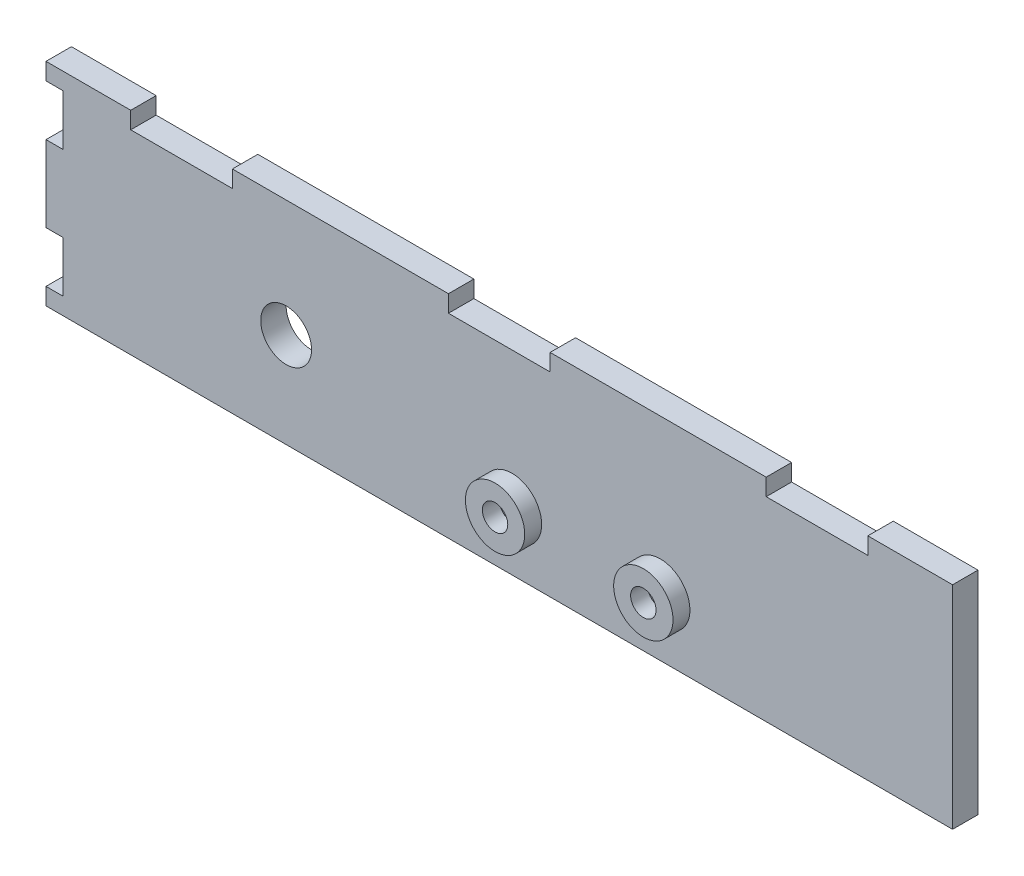
ISO-10303-21;
HEADER;
FILE_DESCRIPTION(('STEP AP214'),'2;1');
FILE_NAME('part.step','',(''),(''),'','','');
FILE_SCHEMA(('AUTOMOTIVE_DESIGN { 1 0 10303 214 1 1 1 1 }'));
ENDSEC;
DATA;
#1=APPLICATION_CONTEXT('core data for automotive mechanical design processes');
#2=APPLICATION_PROTOCOL_DEFINITION('international standard','automotive_design',2000,#1);
#3=PRODUCT_CONTEXT('',#1,'mechanical');
#4=PRODUCT('Part','Part','',(#3));
#5=PRODUCT_RELATED_PRODUCT_CATEGORY('part','',(#4));
#6=PRODUCT_DEFINITION_FORMATION('','',#4);
#7=PRODUCT_DEFINITION_CONTEXT('part definition',#1,'design');
#8=PRODUCT_DEFINITION('design','',#6,#7);
#9=PRODUCT_DEFINITION_SHAPE('','',#8);
#10=(LENGTH_UNIT() NAMED_UNIT(*) SI_UNIT(.MILLI.,.METRE.));
#11=(NAMED_UNIT(*) PLANE_ANGLE_UNIT() SI_UNIT($,.RADIAN.));
#12=(NAMED_UNIT(*) SI_UNIT($,.STERADIAN.) SOLID_ANGLE_UNIT());
#13=UNCERTAINTY_MEASURE_WITH_UNIT(LENGTH_MEASURE(1.E-05),#10,'distance_accuracy_value','');
#14=(GEOMETRIC_REPRESENTATION_CONTEXT(3) GLOBAL_UNCERTAINTY_ASSIGNED_CONTEXT((#13)) GLOBAL_UNIT_ASSIGNED_CONTEXT((#10,
#11,#12)) REPRESENTATION_CONTEXT('',''));
#15=CARTESIAN_POINT('',(0.,0.,0.));
#16=DIRECTION('',(0.,0.,1.));
#17=DIRECTION('',(1.,0.,0.));
#18=AXIS2_PLACEMENT_3D('',#15,#16,#17);
#19=CARTESIAN_POINT('',(0.,0.,3.));
#20=DIRECTION('',(0.,0.,1.));
#21=DIRECTION('',(1.,0.,0.));
#22=AXIS2_PLACEMENT_3D('',#19,#20,#21);
#23=PLANE('',#22);
#24=CARTESIAN_POINT('',(14.3223140495868,15.171694214876,3.));
#25=DIRECTION('',(0.,0.,1.));
#26=DIRECTION('',(1.,0.,0.));
#27=AXIS2_PLACEMENT_3D('',#24,#25,#26);
#28=CIRCLE('',#27,3.5);
#29=CARTESIAN_POINT('',(17.8223140495868,15.171694214876,3.));
#30=VERTEX_POINT('',#29);
#31=EDGE_CURVE('E242',#30,#30,#28,.F.);
#32=ORIENTED_EDGE('',*,*,#31,.T.);
#33=EDGE_LOOP('',(#32));
#34=FACE_BOUND('',#33,.T.);
#35=CARTESIAN_POINT('',(-12.336122998152,19.4527845166274,3.));
#36=DIRECTION('',(0.,0.,1.));
#37=DIRECTION('',(1.,0.,0.));
#38=AXIS2_PLACEMENT_3D('',#35,#36,#37);
#39=CIRCLE('',#38,3.);
#40=CARTESIAN_POINT('',(-9.33612299815198,19.4527845166274,3.));
#41=VERTEX_POINT('',#40);
#42=EDGE_CURVE('E297',#41,#41,#39,.T.);
#43=ORIENTED_EDGE('',*,*,#42,.F.);
#44=EDGE_LOOP('',(#43));
#45=FACE_BOUND('',#44,.T.);
#46=DIRECTION('',(-1.,0.,0.));
#47=VECTOR('',#46,1.);
#48=CARTESIAN_POINT('',(0.,31.271694214876,3.));
#49=LINE('',#48,#47);
#50=CARTESIAN_POINT('',(56.3223140495868,31.271694214876,3.));
#51=VERTEX_POINT('',#50);
#52=CARTESIAN_POINT('',(44.3223140495868,31.271694214876,3.));
#53=VERTEX_POINT('',#52);
#54=EDGE_CURVE('E149',#51,#53,#49,.T.);
#55=ORIENTED_EDGE('',*,*,#54,.T.);
#56=DIRECTION('',(0.,-1.,0.));
#57=VECTOR('',#56,1.);
#58=CARTESIAN_POINT('',(44.3223140495868,0.,3.));
#59=LINE('',#58,#57);
#60=CARTESIAN_POINT('',(44.3223140495868,33.271694214876,3.));
#61=VERTEX_POINT('',#60);
#62=EDGE_CURVE('E380',#61,#53,#59,.T.);
#63=ORIENTED_EDGE('',*,*,#62,.F.);
#64=DIRECTION('',(1.,0.,0.));
#65=VECTOR('',#64,1.);
#66=CARTESIAN_POINT('',(0.,33.271694214876,3.));
#67=LINE('',#66,#65);
#68=CARTESIAN_POINT('',(18.8223140495868,33.271694214876,3.));
#69=VERTEX_POINT('',#68);
#70=EDGE_CURVE('E385',#69,#61,#67,.T.);
#71=ORIENTED_EDGE('',*,*,#70,.F.);
#72=DIRECTION('',(0.,-1.,0.));
#73=VECTOR('',#72,1.);
#74=CARTESIAN_POINT('',(18.8223140495868,0.,3.));
#75=LINE('',#74,#73);
#76=CARTESIAN_POINT('',(18.8223140495868,31.271694214876,3.));
#77=VERTEX_POINT('',#76);
#78=EDGE_CURVE('E388',#69,#77,#75,.T.);
#79=ORIENTED_EDGE('',*,*,#78,.T.);
#80=CARTESIAN_POINT('',(6.82231404958676,31.271694214876,3.));
#81=VERTEX_POINT('',#80);
#82=EDGE_CURVE('E382',#77,#81,#49,.T.);
#83=ORIENTED_EDGE('',*,*,#82,.T.);
#84=DIRECTION('',(0.,-1.,0.));
#85=VECTOR('',#84,1.);
#86=CARTESIAN_POINT('',(6.82231404958676,0.,3.));
#87=LINE('',#86,#85);
#88=CARTESIAN_POINT('',(6.82231404958676,33.271694214876,3.));
#89=VERTEX_POINT('',#88);
#90=EDGE_CURVE('E390',#89,#81,#87,.T.);
#91=ORIENTED_EDGE('',*,*,#90,.F.);
#92=DIRECTION('',(1.,0.,0.));
#93=VECTOR('',#92,1.);
#94=CARTESIAN_POINT('',(0.,33.271694214876,3.));
#95=LINE('',#94,#93);
#96=CARTESIAN_POINT('',(-18.6776859504132,33.271694214876,3.));
#97=VERTEX_POINT('',#96);
#98=EDGE_CURVE('E393',#97,#89,#95,.T.);
#99=ORIENTED_EDGE('',*,*,#98,.F.);
#100=DIRECTION('',(0.,-1.,0.));
#101=VECTOR('',#100,1.);
#102=CARTESIAN_POINT('',(-18.6776859504132,0.,3.));
#103=LINE('',#102,#101);
#104=CARTESIAN_POINT('',(-18.6776859504132,31.271694214876,3.));
#105=VERTEX_POINT('',#104);
#106=EDGE_CURVE('E396',#97,#105,#103,.T.);
#107=ORIENTED_EDGE('',*,*,#106,.T.);
#108=CARTESIAN_POINT('',(-30.6776859504132,31.271694214876,3.));
#109=VERTEX_POINT('',#108);
#110=EDGE_CURVE('E381',#105,#109,#49,.T.);
#111=ORIENTED_EDGE('',*,*,#110,.T.);
#112=DIRECTION('',(0.,-1.,0.));
#113=VECTOR('',#112,1.);
#114=CARTESIAN_POINT('',(-30.6776859504133,1.06434604013651E-13,3.));
#115=LINE('',#114,#113);
#116=CARTESIAN_POINT('',(-30.6776859504132,33.271694214876,3.));
#117=VERTEX_POINT('',#116);
#118=EDGE_CURVE('E398',#117,#109,#115,.T.);
#119=ORIENTED_EDGE('',*,*,#118,.F.);
#120=DIRECTION('',(1.,0.,0.));
#121=VECTOR('',#120,1.);
#122=CARTESIAN_POINT('',(0.,33.271694214876,3.));
#123=LINE('',#122,#121);
#124=CARTESIAN_POINT('',(-40.6776859504132,33.271694214876,3.));
#125=VERTEX_POINT('',#124);
#126=EDGE_CURVE('E401',#125,#117,#123,.T.);
#127=ORIENTED_EDGE('',*,*,#126,.F.);
#128=DIRECTION('',(0.,-1.,0.));
#129=VECTOR('',#128,1.);
#130=CARTESIAN_POINT('',(-40.6776859504132,0.,3.));
#131=LINE('',#130,#129);
#132=CARTESIAN_POINT('',(-40.6776859504132,31.271694214876,3.));
#133=VERTEX_POINT('',#132);
#134=EDGE_CURVE('E404',#125,#133,#131,.T.);
#135=ORIENTED_EDGE('',*,*,#134,.T.);
#136=DIRECTION('',(-1.,0.,0.));
#137=VECTOR('',#136,1.);
#138=CARTESIAN_POINT('',(0.,31.271694214876,3.));
#139=LINE('',#138,#137);
#140=CARTESIAN_POINT('',(-38.6776859504132,31.271694214876,3.));
#141=VERTEX_POINT('',#140);
#142=EDGE_CURVE('E406',#141,#133,#139,.T.);
#143=ORIENTED_EDGE('',*,*,#142,.F.);
#144=DIRECTION('',(0.,-1.,0.));
#145=VECTOR('',#144,1.);
#146=CARTESIAN_POINT('',(-38.6776859504132,0.,3.));
#147=LINE('',#146,#145);
#148=CARTESIAN_POINT('',(-38.6776859504132,25.271694214876,3.));
#149=VERTEX_POINT('',#148);
#150=EDGE_CURVE('E409',#141,#149,#147,.T.);
#151=ORIENTED_EDGE('',*,*,#150,.T.);
#152=DIRECTION('',(-1.,0.,0.));
#153=VECTOR('',#152,1.);
#154=CARTESIAN_POINT('',(0.,25.271694214876,3.));
#155=LINE('',#154,#153);
#156=CARTESIAN_POINT('',(-40.6776859504132,25.271694214876,3.));
#157=VERTEX_POINT('',#156);
#158=EDGE_CURVE('E411',#149,#157,#155,.T.);
#159=ORIENTED_EDGE('',*,*,#158,.T.);
#160=DIRECTION('',(0.,-1.,0.));
#161=VECTOR('',#160,1.);
#162=CARTESIAN_POINT('',(-40.6776859504132,0.,3.));
#163=LINE('',#162,#161);
#164=CARTESIAN_POINT('',(-40.6776859504132,16.271694214876,3.));
#165=VERTEX_POINT('',#164);
#166=EDGE_CURVE('E414',#157,#165,#163,.T.);
#167=ORIENTED_EDGE('',*,*,#166,.T.);
#168=DIRECTION('',(-1.,0.,0.));
#169=VECTOR('',#168,1.);
#170=CARTESIAN_POINT('',(0.,16.271694214876,3.));
#171=LINE('',#170,#169);
#172=CARTESIAN_POINT('',(-38.6776859504132,16.271694214876,3.));
#173=VERTEX_POINT('',#172);
#174=EDGE_CURVE('E416',#173,#165,#171,.T.);
#175=ORIENTED_EDGE('',*,*,#174,.F.);
#176=CARTESIAN_POINT('',(-38.6776859504132,10.271694214876,3.));
#177=VERTEX_POINT('',#176);
#178=EDGE_CURVE('E412',#173,#177,#147,.T.);
#179=ORIENTED_EDGE('',*,*,#178,.T.);
#180=DIRECTION('',(-1.,0.,0.));
#181=VECTOR('',#180,1.);
#182=CARTESIAN_POINT('',(0.,10.271694214876,3.));
#183=LINE('',#182,#181);
#184=CARTESIAN_POINT('',(-40.6776859504132,10.271694214876,3.));
#185=VERTEX_POINT('',#184);
#186=EDGE_CURVE('E419',#177,#185,#183,.T.);
#187=ORIENTED_EDGE('',*,*,#186,.T.);
#188=DIRECTION('',(0.,-1.,0.));
#189=VECTOR('',#188,1.);
#190=CARTESIAN_POINT('',(-40.6776859504132,0.,3.));
#191=LINE('',#190,#189);
#192=CARTESIAN_POINT('',(-40.6776859504132,8.27169421487603,3.));
#193=VERTEX_POINT('',#192);
#194=EDGE_CURVE('E421',#185,#193,#191,.T.);
#195=ORIENTED_EDGE('',*,*,#194,.T.);
#196=DIRECTION('',(1.,0.,0.));
#197=VECTOR('',#196,1.);
#198=CARTESIAN_POINT('',(0.,8.27169421487603,3.));
#199=LINE('',#198,#197);
#200=CARTESIAN_POINT('',(66.3223140495868,8.27169421487603,3.));
#201=VERTEX_POINT('',#200);
#202=EDGE_CURVE('E229',#193,#201,#199,.T.);
#203=ORIENTED_EDGE('',*,*,#202,.T.);
#204=DIRECTION('',(0.,-1.,0.));
#205=VECTOR('',#204,1.);
#206=CARTESIAN_POINT('',(66.3223140495868,0.,3.));
#207=LINE('',#206,#205);
#208=CARTESIAN_POINT('',(66.3223140495868,33.271694214876,3.));
#209=VERTEX_POINT('',#208);
#210=EDGE_CURVE('E217',#209,#201,#207,.T.);
#211=ORIENTED_EDGE('',*,*,#210,.F.);
#212=DIRECTION('',(1.,0.,0.));
#213=VECTOR('',#212,1.);
#214=CARTESIAN_POINT('',(0.,33.271694214876,3.));
#215=LINE('',#214,#213);
#216=CARTESIAN_POINT('',(56.3223140495868,33.271694214876,3.));
#217=VERTEX_POINT('',#216);
#218=EDGE_CURVE('E227',#217,#209,#215,.T.);
#219=ORIENTED_EDGE('',*,*,#218,.F.);
#220=DIRECTION('',(0.,-1.,0.));
#221=VECTOR('',#220,1.);
#222=CARTESIAN_POINT('',(56.3223140495868,0.,3.));
#223=LINE('',#222,#221);
#224=EDGE_CURVE('E64',#217,#51,#223,.T.);
#225=ORIENTED_EDGE('',*,*,#224,.T.);
#226=EDGE_LOOP('',(#55,#63,#71,#79,#83,#91,#99,#107,#111,#119,#127,#135,#143,#151,#159,#167,
#175,#179,#187,#195,#203,#211,#219,#225));
#227=FACE_BOUND('',#226,.T.);
#228=CARTESIAN_POINT('',(31.8223140495868,15.171694214876,3.));
#229=DIRECTION('',(0.,0.,1.));
#230=DIRECTION('',(1.,0.,0.));
#231=AXIS2_PLACEMENT_3D('',#228,#229,#230);
#232=CIRCLE('',#231,3.5);
#233=CARTESIAN_POINT('',(35.3223140495868,15.171694214876,3.));
#234=VERTEX_POINT('',#233);
#235=EDGE_CURVE('E361',#234,#234,#232,.F.);
#236=ORIENTED_EDGE('',*,*,#235,.T.);
#237=EDGE_LOOP('',(#236));
#238=FACE_BOUND('',#237,.T.);
#239=ADVANCED_FACE('F47',(#34,#45,#227,#238),#23,.T.);
#240=CARTESIAN_POINT('',(0.,31.271694214876,3.));
#241=DIRECTION('',(0.,-1.,0.));
#242=DIRECTION('',(1.,0.,0.));
#243=AXIS2_PLACEMENT_3D('',#240,#241,#242);
#244=PLANE('',#243);
#245=DIRECTION('',(-1.,0.,0.));
#246=VECTOR('',#245,1.);
#247=CARTESIAN_POINT('',(0.,31.271694214876,0.));
#248=LINE('',#247,#246);
#249=CARTESIAN_POINT('',(56.3223140495868,31.271694214876,0.));
#250=VERTEX_POINT('',#249);
#251=CARTESIAN_POINT('',(44.3223140495868,31.271694214876,0.));
#252=VERTEX_POINT('',#251);
#253=EDGE_CURVE('E241',#250,#252,#248,.T.);
#254=ORIENTED_EDGE('',*,*,#253,.T.);
#255=DIRECTION('',(0.,0.,-1.));
#256=VECTOR('',#255,1.);
#257=CARTESIAN_POINT('',(44.3223140495868,31.271694214876,3.));
#258=LINE('',#257,#256);
#259=EDGE_CURVE('E346',#53,#252,#258,.T.);
#260=ORIENTED_EDGE('',*,*,#259,.F.);
#261=ORIENTED_EDGE('',*,*,#54,.F.);
#262=DIRECTION('',(0.,0.,-1.));
#263=VECTOR('',#262,1.);
#264=CARTESIAN_POINT('',(56.3223140495868,31.271694214876,3.));
#265=LINE('',#264,#263);
#266=EDGE_CURVE('E234',#51,#250,#265,.T.);
#267=ORIENTED_EDGE('',*,*,#266,.T.);
#268=EDGE_LOOP('',(#254,#260,#261,#267));
#269=FACE_BOUND('',#268,.T.);
#270=ADVANCED_FACE('F436',(#269),#244,.F.);
#271=CARTESIAN_POINT('',(44.3223140495868,0.,3.));
#272=DIRECTION('',(1.,0.,0.));
#273=DIRECTION('',(0.,0.,-1.));
#274=AXIS2_PLACEMENT_3D('',#271,#272,#273);
#275=PLANE('',#274);
#276=DIRECTION('',(0.,-1.,0.));
#277=VECTOR('',#276,1.);
#278=CARTESIAN_POINT('',(44.3223140495868,0.,0.));
#279=LINE('',#278,#277);
#280=CARTESIAN_POINT('',(44.3223140495868,33.271694214876,0.));
#281=VERTEX_POINT('',#280);
#282=EDGE_CURVE('E245',#281,#252,#279,.T.);
#283=ORIENTED_EDGE('',*,*,#282,.F.);
#284=DIRECTION('',(0.,0.,-1.));
#285=VECTOR('',#284,1.);
#286=CARTESIAN_POINT('',(44.3223140495868,33.271694214876,3.));
#287=LINE('',#286,#285);
#288=EDGE_CURVE('E344',#61,#281,#287,.T.);
#289=ORIENTED_EDGE('',*,*,#288,.F.);
#290=ORIENTED_EDGE('',*,*,#62,.T.);
#291=ORIENTED_EDGE('',*,*,#259,.T.);
#292=EDGE_LOOP('',(#283,#289,#290,#291));
#293=FACE_BOUND('',#292,.T.);
#294=ADVANCED_FACE('F455',(#293),#275,.T.);
#295=CARTESIAN_POINT('',(0.,33.271694214876,3.));
#296=DIRECTION('',(0.,1.,0.));
#297=DIRECTION('',(0.,0.,1.));
#298=AXIS2_PLACEMENT_3D('',#295,#296,#297);
#299=PLANE('',#298);
#300=DIRECTION('',(1.,0.,0.));
#301=VECTOR('',#300,1.);
#302=CARTESIAN_POINT('',(0.,33.271694214876,0.));
#303=LINE('',#302,#301);
#304=CARTESIAN_POINT('',(18.8223140495868,33.271694214876,0.));
#305=VERTEX_POINT('',#304);
#306=EDGE_CURVE('E250',#305,#281,#303,.T.);
#307=ORIENTED_EDGE('',*,*,#306,.F.);
#308=DIRECTION('',(0.,0.,-1.));
#309=VECTOR('',#308,1.);
#310=CARTESIAN_POINT('',(18.8223140495868,33.271694214876,3.));
#311=LINE('',#310,#309);
#312=EDGE_CURVE('E342',#69,#305,#311,.T.);
#313=ORIENTED_EDGE('',*,*,#312,.F.);
#314=ORIENTED_EDGE('',*,*,#70,.T.);
#315=ORIENTED_EDGE('',*,*,#288,.T.);
#316=EDGE_LOOP('',(#307,#313,#314,#315));
#317=FACE_BOUND('',#316,.T.);
#318=ADVANCED_FACE('F729',(#317),#299,.T.);
#319=CARTESIAN_POINT('',(18.8223140495868,0.,3.));
#320=DIRECTION('',(1.,0.,0.));
#321=DIRECTION('',(0.,0.,-1.));
#322=AXIS2_PLACEMENT_3D('',#319,#320,#321);
#323=PLANE('',#322);
#324=DIRECTION('',(0.,-1.,0.));
#325=VECTOR('',#324,1.);
#326=CARTESIAN_POINT('',(18.8223140495868,0.,0.));
#327=LINE('',#326,#325);
#328=CARTESIAN_POINT('',(18.8223140495868,31.271694214876,0.));
#329=VERTEX_POINT('',#328);
#330=EDGE_CURVE('E253',#305,#329,#327,.T.);
#331=ORIENTED_EDGE('',*,*,#330,.T.);
#332=DIRECTION('',(0.,0.,-1.));
#333=VECTOR('',#332,1.);
#334=CARTESIAN_POINT('',(18.8223140495868,31.271694214876,3.));
#335=LINE('',#334,#333);
#336=EDGE_CURVE('E339',#77,#329,#335,.T.);
#337=ORIENTED_EDGE('',*,*,#336,.F.);
#338=ORIENTED_EDGE('',*,*,#78,.F.);
#339=ORIENTED_EDGE('',*,*,#312,.T.);
#340=EDGE_LOOP('',(#331,#337,#338,#339));
#341=FACE_BOUND('',#340,.T.);
#342=ADVANCED_FACE('F719',(#341),#323,.F.);
#343=CARTESIAN_POINT('',(6.82231404958676,31.271694214876,0.));
#344=VERTEX_POINT('',#343);
#345=EDGE_CURVE('E247',#329,#344,#248,.T.);
#346=ORIENTED_EDGE('',*,*,#345,.T.);
#347=DIRECTION('',(0.,0.,-1.));
#348=VECTOR('',#347,1.);
#349=CARTESIAN_POINT('',(6.82231404958676,31.271694214876,3.));
#350=LINE('',#349,#348);
#351=EDGE_CURVE('E337',#81,#344,#350,.T.);
#352=ORIENTED_EDGE('',*,*,#351,.F.);
#353=ORIENTED_EDGE('',*,*,#82,.F.);
#354=ORIENTED_EDGE('',*,*,#336,.T.);
#355=EDGE_LOOP('',(#346,#352,#353,#354));
#356=FACE_BOUND('',#355,.T.);
#357=ADVANCED_FACE('F457',(#356),#244,.F.);
#358=CARTESIAN_POINT('',(6.82231404958676,0.,3.));
#359=DIRECTION('',(1.,0.,0.));
#360=DIRECTION('',(0.,0.,-1.));
#361=AXIS2_PLACEMENT_3D('',#358,#359,#360);
#362=PLANE('',#361);
#363=DIRECTION('',(0.,-1.,0.));
#364=VECTOR('',#363,1.);
#365=CARTESIAN_POINT('',(6.82231404958676,0.,0.));
#366=LINE('',#365,#364);
#367=CARTESIAN_POINT('',(6.82231404958676,33.271694214876,0.));
#368=VERTEX_POINT('',#367);
#369=EDGE_CURVE('E255',#368,#344,#366,.T.);
#370=ORIENTED_EDGE('',*,*,#369,.F.);
#371=DIRECTION('',(0.,0.,-1.));
#372=VECTOR('',#371,1.);
#373=CARTESIAN_POINT('',(6.82231404958676,33.271694214876,3.));
#374=LINE('',#373,#372);
#375=EDGE_CURVE('E335',#89,#368,#374,.T.);
#376=ORIENTED_EDGE('',*,*,#375,.F.);
#377=ORIENTED_EDGE('',*,*,#90,.T.);
#378=ORIENTED_EDGE('',*,*,#351,.T.);
#379=EDGE_LOOP('',(#370,#376,#377,#378));
#380=FACE_BOUND('',#379,.T.);
#381=ADVANCED_FACE('F700',(#380),#362,.T.);
#382=CARTESIAN_POINT('',(0.,33.271694214876,3.));
#383=DIRECTION('',(0.,1.,0.));
#384=DIRECTION('',(0.,0.,1.));
#385=AXIS2_PLACEMENT_3D('',#382,#383,#384);
#386=PLANE('',#385);
#387=DIRECTION('',(1.,0.,0.));
#388=VECTOR('',#387,1.);
#389=CARTESIAN_POINT('',(0.,33.271694214876,0.));
#390=LINE('',#389,#388);
#391=CARTESIAN_POINT('',(-18.6776859504132,33.271694214876,0.));
#392=VERTEX_POINT('',#391);
#393=EDGE_CURVE('E258',#392,#368,#390,.T.);
#394=ORIENTED_EDGE('',*,*,#393,.F.);
#395=DIRECTION('',(0.,0.,-1.));
#396=VECTOR('',#395,1.);
#397=CARTESIAN_POINT('',(-18.6776859504132,33.271694214876,3.));
#398=LINE('',#397,#396);
#399=EDGE_CURVE('E333',#97,#392,#398,.T.);
#400=ORIENTED_EDGE('',*,*,#399,.F.);
#401=ORIENTED_EDGE('',*,*,#98,.T.);
#402=ORIENTED_EDGE('',*,*,#375,.T.);
#403=EDGE_LOOP('',(#394,#400,#401,#402));
#404=FACE_BOUND('',#403,.T.);
#405=ADVANCED_FACE('F689',(#404),#386,.T.);
#406=CARTESIAN_POINT('',(-18.6776859504132,0.,3.));
#407=DIRECTION('',(1.,0.,0.));
#408=DIRECTION('',(0.,0.,-1.));
#409=AXIS2_PLACEMENT_3D('',#406,#407,#408);
#410=PLANE('',#409);
#411=DIRECTION('',(0.,-1.,0.));
#412=VECTOR('',#411,1.);
#413=CARTESIAN_POINT('',(-18.6776859504132,0.,0.));
#414=LINE('',#413,#412);
#415=CARTESIAN_POINT('',(-18.6776859504132,31.271694214876,0.));
#416=VERTEX_POINT('',#415);
#417=EDGE_CURVE('E261',#392,#416,#414,.T.);
#418=ORIENTED_EDGE('',*,*,#417,.T.);
#419=DIRECTION('',(0.,0.,-1.));
#420=VECTOR('',#419,1.);
#421=CARTESIAN_POINT('',(-18.6776859504132,31.271694214876,3.));
#422=LINE('',#421,#420);
#423=EDGE_CURVE('E330',#105,#416,#422,.T.);
#424=ORIENTED_EDGE('',*,*,#423,.F.);
#425=ORIENTED_EDGE('',*,*,#106,.F.);
#426=ORIENTED_EDGE('',*,*,#399,.T.);
#427=EDGE_LOOP('',(#418,#424,#425,#426));
#428=FACE_BOUND('',#427,.T.);
#429=ADVANCED_FACE('F679',(#428),#410,.F.);
#430=CARTESIAN_POINT('',(-30.6776859504132,31.271694214876,0.));
#431=VERTEX_POINT('',#430);
#432=EDGE_CURVE('E246',#416,#431,#248,.T.);
#433=ORIENTED_EDGE('',*,*,#432,.T.);
#434=DIRECTION('',(0.,0.,-1.));
#435=VECTOR('',#434,1.);
#436=CARTESIAN_POINT('',(-30.6776859504132,31.271694214876,3.));
#437=LINE('',#436,#435);
#438=EDGE_CURVE('E328',#109,#431,#437,.T.);
#439=ORIENTED_EDGE('',*,*,#438,.F.);
#440=ORIENTED_EDGE('',*,*,#110,.F.);
#441=ORIENTED_EDGE('',*,*,#423,.T.);
#442=EDGE_LOOP('',(#433,#439,#440,#441));
#443=FACE_BOUND('',#442,.T.);
#444=ADVANCED_FACE('F458',(#443),#244,.F.);
#445=CARTESIAN_POINT('',(-30.6776859504133,1.06434604013651E-13,3.));
#446=DIRECTION('',(1.,0.,0.));
#447=DIRECTION('',(0.,1.,0.));
#448=AXIS2_PLACEMENT_3D('',#445,#446,#447);
#449=PLANE('',#448);
#450=DIRECTION('',(0.,-1.,0.));
#451=VECTOR('',#450,1.);
#452=CARTESIAN_POINT('',(-30.6776859504133,1.06434604013651E-13,0.));
#453=LINE('',#452,#451);
#454=CARTESIAN_POINT('',(-30.6776859504132,33.271694214876,0.));
#455=VERTEX_POINT('',#454);
#456=EDGE_CURVE('E263',#455,#431,#453,.T.);
#457=ORIENTED_EDGE('',*,*,#456,.F.);
#458=DIRECTION('',(0.,0.,-1.));
#459=VECTOR('',#458,1.);
#460=CARTESIAN_POINT('',(-30.6776859504132,33.271694214876,3.));
#461=LINE('',#460,#459);
#462=EDGE_CURVE('E326',#117,#455,#461,.T.);
#463=ORIENTED_EDGE('',*,*,#462,.F.);
#464=ORIENTED_EDGE('',*,*,#118,.T.);
#465=ORIENTED_EDGE('',*,*,#438,.T.);
#466=EDGE_LOOP('',(#457,#463,#464,#465));
#467=FACE_BOUND('',#466,.T.);
#468=ADVANCED_FACE('F660',(#467),#449,.T.);
#469=CARTESIAN_POINT('',(0.,33.271694214876,3.));
#470=DIRECTION('',(0.,1.,0.));
#471=DIRECTION('',(0.,0.,1.));
#472=AXIS2_PLACEMENT_3D('',#469,#470,#471);
#473=PLANE('',#472);
#474=DIRECTION('',(1.,0.,0.));
#475=VECTOR('',#474,1.);
#476=CARTESIAN_POINT('',(0.,33.271694214876,0.));
#477=LINE('',#476,#475);
#478=CARTESIAN_POINT('',(-40.6776859504132,33.271694214876,0.));
#479=VERTEX_POINT('',#478);
#480=EDGE_CURVE('E266',#479,#455,#477,.T.);
#481=ORIENTED_EDGE('',*,*,#480,.F.);
#482=DIRECTION('',(0.,0.,-1.));
#483=VECTOR('',#482,1.);
#484=CARTESIAN_POINT('',(-40.6776859504132,33.271694214876,3.));
#485=LINE('',#484,#483);
#486=EDGE_CURVE('E324',#125,#479,#485,.T.);
#487=ORIENTED_EDGE('',*,*,#486,.F.);
#488=ORIENTED_EDGE('',*,*,#126,.T.);
#489=ORIENTED_EDGE('',*,*,#462,.T.);
#490=EDGE_LOOP('',(#481,#487,#488,#489));
#491=FACE_BOUND('',#490,.T.);
#492=ADVANCED_FACE('F650',(#491),#473,.T.);
#493=CARTESIAN_POINT('',(-40.6776859504132,0.,3.));
#494=DIRECTION('',(1.,0.,0.));
#495=DIRECTION('',(0.,1.,0.));
#496=AXIS2_PLACEMENT_3D('',#493,#494,#495);
#497=PLANE('',#496);
#498=DIRECTION('',(0.,-1.,0.));
#499=VECTOR('',#498,1.);
#500=CARTESIAN_POINT('',(-40.6776859504132,0.,0.));
#501=LINE('',#500,#499);
#502=CARTESIAN_POINT('',(-40.6776859504132,31.271694214876,0.));
#503=VERTEX_POINT('',#502);
#504=EDGE_CURVE('E269',#479,#503,#501,.T.);
#505=ORIENTED_EDGE('',*,*,#504,.T.);
#506=DIRECTION('',(0.,0.,-1.));
#507=VECTOR('',#506,1.);
#508=CARTESIAN_POINT('',(-40.6776859504132,31.271694214876,3.));
#509=LINE('',#508,#507);
#510=EDGE_CURVE('E322',#133,#503,#509,.T.);
#511=ORIENTED_EDGE('',*,*,#510,.F.);
#512=ORIENTED_EDGE('',*,*,#134,.F.);
#513=ORIENTED_EDGE('',*,*,#486,.T.);
#514=EDGE_LOOP('',(#505,#511,#512,#513));
#515=FACE_BOUND('',#514,.T.);
#516=ADVANCED_FACE('F639',(#515),#497,.F.);
#517=CARTESIAN_POINT('',(0.,31.271694214876,3.));
#518=DIRECTION('',(0.,-1.,0.));
#519=DIRECTION('',(1.,0.,0.));
#520=AXIS2_PLACEMENT_3D('',#517,#518,#519);
#521=PLANE('',#520);
#522=DIRECTION('',(-1.,0.,0.));
#523=VECTOR('',#522,1.);
#524=CARTESIAN_POINT('',(0.,31.271694214876,0.));
#525=LINE('',#524,#523);
#526=CARTESIAN_POINT('',(-38.6776859504132,31.271694214876,0.));
#527=VERTEX_POINT('',#526);
#528=EDGE_CURVE('E272',#527,#503,#525,.T.);
#529=ORIENTED_EDGE('',*,*,#528,.F.);
#530=DIRECTION('',(0.,0.,-1.));
#531=VECTOR('',#530,1.);
#532=CARTESIAN_POINT('',(-38.6776859504132,31.271694214876,3.));
#533=LINE('',#532,#531);
#534=EDGE_CURVE('E320',#141,#527,#533,.T.);
#535=ORIENTED_EDGE('',*,*,#534,.F.);
#536=ORIENTED_EDGE('',*,*,#142,.T.);
#537=ORIENTED_EDGE('',*,*,#510,.T.);
#538=EDGE_LOOP('',(#529,#535,#536,#537));
#539=FACE_BOUND('',#538,.T.);
#540=ADVANCED_FACE('F629',(#539),#521,.T.);
#541=CARTESIAN_POINT('',(-38.6776859504132,0.,3.));
#542=DIRECTION('',(1.,0.,0.));
#543=DIRECTION('',(0.,1.,0.));
#544=AXIS2_PLACEMENT_3D('',#541,#542,#543);
#545=PLANE('',#544);
#546=DIRECTION('',(0.,-1.,0.));
#547=VECTOR('',#546,1.);
#548=CARTESIAN_POINT('',(-38.6776859504132,0.,0.));
#549=LINE('',#548,#547);
#550=CARTESIAN_POINT('',(-38.6776859504132,25.271694214876,0.));
#551=VERTEX_POINT('',#550);
#552=EDGE_CURVE('E275',#527,#551,#549,.T.);
#553=ORIENTED_EDGE('',*,*,#552,.T.);
#554=DIRECTION('',(0.,0.,-1.));
#555=VECTOR('',#554,1.);
#556=CARTESIAN_POINT('',(-38.6776859504132,25.271694214876,3.));
#557=LINE('',#556,#555);
#558=EDGE_CURVE('E317',#149,#551,#557,.T.);
#559=ORIENTED_EDGE('',*,*,#558,.F.);
#560=ORIENTED_EDGE('',*,*,#150,.F.);
#561=ORIENTED_EDGE('',*,*,#534,.T.);
#562=EDGE_LOOP('',(#553,#559,#560,#561));
#563=FACE_BOUND('',#562,.T.);
#564=ADVANCED_FACE('F591',(#563),#545,.F.);
#565=CARTESIAN_POINT('',(0.,25.271694214876,3.));
#566=DIRECTION('',(0.,-1.,0.));
#567=DIRECTION('',(0.,0.,-1.));
#568=AXIS2_PLACEMENT_3D('',#565,#566,#567);
#569=PLANE('',#568);
#570=DIRECTION('',(-1.,0.,0.));
#571=VECTOR('',#570,1.);
#572=CARTESIAN_POINT('',(0.,25.271694214876,0.));
#573=LINE('',#572,#571);
#574=CARTESIAN_POINT('',(-40.6776859504132,25.271694214876,0.));
#575=VERTEX_POINT('',#574);
#576=EDGE_CURVE('E277',#551,#575,#573,.T.);
#577=ORIENTED_EDGE('',*,*,#576,.T.);
#578=DIRECTION('',(0.,0.,-1.));
#579=VECTOR('',#578,1.);
#580=CARTESIAN_POINT('',(-40.6776859504132,25.271694214876,3.));
#581=LINE('',#580,#579);
#582=EDGE_CURVE('E314',#157,#575,#581,.T.);
#583=ORIENTED_EDGE('',*,*,#582,.F.);
#584=ORIENTED_EDGE('',*,*,#158,.F.);
#585=ORIENTED_EDGE('',*,*,#558,.T.);
#586=EDGE_LOOP('',(#577,#583,#584,#585));
#587=FACE_BOUND('',#586,.T.);
#588=ADVANCED_FACE('F610',(#587),#569,.F.);
#589=CARTESIAN_POINT('',(-40.6776859504132,0.,3.));
#590=DIRECTION('',(1.,0.,0.));
#591=DIRECTION('',(0.,1.,0.));
#592=AXIS2_PLACEMENT_3D('',#589,#590,#591);
#593=PLANE('',#592);
#594=DIRECTION('',(0.,-1.,0.));
#595=VECTOR('',#594,1.);
#596=CARTESIAN_POINT('',(-40.6776859504132,0.,0.));
#597=LINE('',#596,#595);
#598=CARTESIAN_POINT('',(-40.6776859504132,16.271694214876,0.));
#599=VERTEX_POINT('',#598);
#600=EDGE_CURVE('E280',#575,#599,#597,.T.);
#601=ORIENTED_EDGE('',*,*,#600,.T.);
#602=DIRECTION('',(0.,0.,-1.));
#603=VECTOR('',#602,1.);
#604=CARTESIAN_POINT('',(-40.6776859504132,16.271694214876,3.));
#605=LINE('',#604,#603);
#606=EDGE_CURVE('E312',#165,#599,#605,.T.);
#607=ORIENTED_EDGE('',*,*,#606,.F.);
#608=ORIENTED_EDGE('',*,*,#166,.F.);
#609=ORIENTED_EDGE('',*,*,#582,.T.);
#610=EDGE_LOOP('',(#601,#607,#608,#609));
#611=FACE_BOUND('',#610,.T.);
#612=ADVANCED_FACE('F600',(#611),#593,.F.);
#613=CARTESIAN_POINT('',(0.,16.271694214876,3.));
#614=DIRECTION('',(0.,-1.,0.));
#615=DIRECTION('',(0.,0.,-1.));
#616=AXIS2_PLACEMENT_3D('',#613,#614,#615);
#617=PLANE('',#616);
#618=DIRECTION('',(-1.,0.,0.));
#619=VECTOR('',#618,1.);
#620=CARTESIAN_POINT('',(0.,16.271694214876,0.));
#621=LINE('',#620,#619);
#622=CARTESIAN_POINT('',(-38.6776859504132,16.271694214876,0.));
#623=VERTEX_POINT('',#622);
#624=EDGE_CURVE('E283',#623,#599,#621,.T.);
#625=ORIENTED_EDGE('',*,*,#624,.F.);
#626=DIRECTION('',(0.,0.,-1.));
#627=VECTOR('',#626,1.);
#628=CARTESIAN_POINT('',(-38.6776859504132,16.271694214876,3.));
#629=LINE('',#628,#627);
#630=EDGE_CURVE('E310',#173,#623,#629,.T.);
#631=ORIENTED_EDGE('',*,*,#630,.F.);
#632=ORIENTED_EDGE('',*,*,#174,.T.);
#633=ORIENTED_EDGE('',*,*,#606,.T.);
#634=EDGE_LOOP('',(#625,#631,#632,#633));
#635=FACE_BOUND('',#634,.T.);
#636=ADVANCED_FACE('F588',(#635),#617,.T.);
#637=CARTESIAN_POINT('',(-38.6776859504132,10.271694214876,0.));
#638=VERTEX_POINT('',#637);
#639=EDGE_CURVE('E278',#623,#638,#549,.T.);
#640=ORIENTED_EDGE('',*,*,#639,.T.);
#641=DIRECTION('',(0.,0.,-1.));
#642=VECTOR('',#641,1.);
#643=CARTESIAN_POINT('',(-38.6776859504132,10.271694214876,3.));
#644=LINE('',#643,#642);
#645=EDGE_CURVE('E307',#177,#638,#644,.T.);
#646=ORIENTED_EDGE('',*,*,#645,.F.);
#647=ORIENTED_EDGE('',*,*,#178,.F.);
#648=ORIENTED_EDGE('',*,*,#630,.T.);
#649=EDGE_LOOP('',(#640,#646,#647,#648));
#650=FACE_BOUND('',#649,.T.);
#651=ADVANCED_FACE('F578',(#650),#545,.F.);
#652=CARTESIAN_POINT('',(0.,10.271694214876,3.));
#653=DIRECTION('',(0.,-1.,0.));
#654=DIRECTION('',(0.,0.,-1.));
#655=AXIS2_PLACEMENT_3D('',#652,#653,#654);
#656=PLANE('',#655);
#657=DIRECTION('',(-1.,0.,0.));
#658=VECTOR('',#657,1.);
#659=CARTESIAN_POINT('',(0.,10.271694214876,0.));
#660=LINE('',#659,#658);
#661=CARTESIAN_POINT('',(-40.6776859504132,10.271694214876,0.));
#662=VERTEX_POINT('',#661);
#663=EDGE_CURVE('E286',#638,#662,#660,.T.);
#664=ORIENTED_EDGE('',*,*,#663,.T.);
#665=DIRECTION('',(0.,0.,-1.));
#666=VECTOR('',#665,1.);
#667=CARTESIAN_POINT('',(-40.6776859504132,10.271694214876,3.));
#668=LINE('',#667,#666);
#669=EDGE_CURVE('E304',#185,#662,#668,.T.);
#670=ORIENTED_EDGE('',*,*,#669,.F.);
#671=ORIENTED_EDGE('',*,*,#186,.F.);
#672=ORIENTED_EDGE('',*,*,#645,.T.);
#673=EDGE_LOOP('',(#664,#670,#671,#672));
#674=FACE_BOUND('',#673,.T.);
#675=ADVANCED_FACE('F569',(#674),#656,.F.);
#676=CARTESIAN_POINT('',(-40.6776859504132,0.,3.));
#677=DIRECTION('',(1.,0.,0.));
#678=DIRECTION('',(0.,1.,0.));
#679=AXIS2_PLACEMENT_3D('',#676,#677,#678);
#680=PLANE('',#679);
#681=DIRECTION('',(0.,-1.,0.));
#682=VECTOR('',#681,1.);
#683=CARTESIAN_POINT('',(-40.6776859504132,0.,0.));
#684=LINE('',#683,#682);
#685=CARTESIAN_POINT('',(-40.6776859504132,8.27169421487603,0.));
#686=VERTEX_POINT('',#685);
#687=EDGE_CURVE('E288',#662,#686,#684,.T.);
#688=ORIENTED_EDGE('',*,*,#687,.T.);
#689=DIRECTION('',(0.,0.,-1.));
#690=VECTOR('',#689,1.);
#691=CARTESIAN_POINT('',(-40.6776859504132,8.27169421487603,3.));
#692=LINE('',#691,#690);
#693=EDGE_CURVE('E301',#193,#686,#692,.T.);
#694=ORIENTED_EDGE('',*,*,#693,.F.);
#695=ORIENTED_EDGE('',*,*,#194,.F.);
#696=ORIENTED_EDGE('',*,*,#669,.T.);
#697=EDGE_LOOP('',(#688,#694,#695,#696));
#698=FACE_BOUND('',#697,.T.);
#699=ADVANCED_FACE('F427',(#698),#680,.F.);
#700=CARTESIAN_POINT('',(0.,8.27169421487603,3.));
#701=DIRECTION('',(0.,1.,0.));
#702=DIRECTION('',(0.,0.,1.));
#703=AXIS2_PLACEMENT_3D('',#700,#701,#702);
#704=PLANE('',#703);
#705=DIRECTION('',(1.,0.,0.));
#706=VECTOR('',#705,1.);
#707=CARTESIAN_POINT('',(0.,8.27169421487603,0.));
#708=LINE('',#707,#706);
#709=CARTESIAN_POINT('',(66.3223140495868,8.27169421487603,0.));
#710=VERTEX_POINT('',#709);
#711=EDGE_CURVE('E290',#686,#710,#708,.T.);
#712=ORIENTED_EDGE('',*,*,#711,.T.);
#713=DIRECTION('',(0.,0.,-1.));
#714=VECTOR('',#713,1.);
#715=CARTESIAN_POINT('',(66.3223140495868,8.27169421487603,3.));
#716=LINE('',#715,#714);
#717=EDGE_CURVE('E224',#201,#710,#716,.T.);
#718=ORIENTED_EDGE('',*,*,#717,.F.);
#719=ORIENTED_EDGE('',*,*,#202,.F.);
#720=ORIENTED_EDGE('',*,*,#693,.T.);
#721=EDGE_LOOP('',(#712,#718,#719,#720));
#722=FACE_BOUND('',#721,.T.);
#723=ADVANCED_FACE('F431',(#722),#704,.F.);
#724=CARTESIAN_POINT('',(66.3223140495868,0.,3.));
#725=DIRECTION('',(1.,0.,0.));
#726=DIRECTION('',(0.,1.,0.));
#727=AXIS2_PLACEMENT_3D('',#724,#725,#726);
#728=PLANE('',#727);
#729=DIRECTION('',(0.,-1.,0.));
#730=VECTOR('',#729,1.);
#731=CARTESIAN_POINT('',(66.3223140495868,0.,0.));
#732=LINE('',#731,#730);
#733=CARTESIAN_POINT('',(66.3223140495868,33.271694214876,0.));
#734=VERTEX_POINT('',#733);
#735=EDGE_CURVE('E219',#734,#710,#732,.T.);
#736=ORIENTED_EDGE('',*,*,#735,.F.);
#737=DIRECTION('',(0.,0.,-1.));
#738=VECTOR('',#737,1.);
#739=CARTESIAN_POINT('',(66.3223140495868,33.271694214876,3.));
#740=LINE('',#739,#738);
#741=EDGE_CURVE('E214',#209,#734,#740,.T.);
#742=ORIENTED_EDGE('',*,*,#741,.F.);
#743=ORIENTED_EDGE('',*,*,#210,.T.);
#744=ORIENTED_EDGE('',*,*,#717,.T.);
#745=EDGE_LOOP('',(#736,#742,#743,#744));
#746=FACE_BOUND('',#745,.T.);
#747=ADVANCED_FACE('F216',(#746),#728,.T.);
#748=CARTESIAN_POINT('',(0.,33.271694214876,3.));
#749=DIRECTION('',(0.,1.,0.));
#750=DIRECTION('',(0.,0.,1.));
#751=AXIS2_PLACEMENT_3D('',#748,#749,#750);
#752=PLANE('',#751);
#753=DIRECTION('',(1.,0.,0.));
#754=VECTOR('',#753,1.);
#755=CARTESIAN_POINT('',(0.,33.271694214876,0.));
#756=LINE('',#755,#754);
#757=CARTESIAN_POINT('',(56.3223140495868,33.271694214876,0.));
#758=VERTEX_POINT('',#757);
#759=EDGE_CURVE('E294',#758,#734,#756,.T.);
#760=ORIENTED_EDGE('',*,*,#759,.F.);
#761=DIRECTION('',(0.,0.,-1.));
#762=VECTOR('',#761,1.);
#763=CARTESIAN_POINT('',(56.3223140495868,33.271694214876,3.));
#764=LINE('',#763,#762);
#765=EDGE_CURVE('E140',#217,#758,#764,.T.);
#766=ORIENTED_EDGE('',*,*,#765,.F.);
#767=ORIENTED_EDGE('',*,*,#218,.T.);
#768=ORIENTED_EDGE('',*,*,#741,.T.);
#769=EDGE_LOOP('',(#760,#766,#767,#768));
#770=FACE_BOUND('',#769,.T.);
#771=ADVANCED_FACE('F232',(#770),#752,.T.);
#772=CARTESIAN_POINT('',(14.3223140495868,15.171694214876,3.));
#773=DIRECTION('',(0.,0.,-1.));
#774=DIRECTION('',(-1.,0.,0.));
#775=AXIS2_PLACEMENT_3D('',#772,#773,#774);
#776=CYLINDRICAL_SURFACE('',#775,1.5);
#777=CARTESIAN_POINT('',(14.3223140495868,15.171694214876,3.));
#778=DIRECTION('',(0.,0.,1.));
#779=DIRECTION('',(1.,0.,0.));
#780=AXIS2_PLACEMENT_3D('',#777,#778,#779);
#781=CIRCLE('',#780,1.5);
#782=CARTESIAN_POINT('',(15.8223140495868,15.171694214876,3.));
#783=VERTEX_POINT('',#782);
#784=EDGE_CURVE('E12',#783,#783,#781,.T.);
#785=ORIENTED_EDGE('',*,*,#784,.F.);
#786=EDGE_LOOP('',(#785));
#787=FACE_BOUND('',#786,.T.);
#788=CARTESIAN_POINT('',(14.3223140495868,15.171694214876,5.));
#789=DIRECTION('',(0.,0.,1.));
#790=DIRECTION('',(1.,0.,0.));
#791=AXIS2_PLACEMENT_3D('',#788,#789,#790);
#792=CIRCLE('',#791,1.5);
#793=CARTESIAN_POINT('',(15.8223140495868,15.171694214876,5.));
#794=VERTEX_POINT('',#793);
#795=EDGE_CURVE('E365',#794,#794,#792,.T.);
#796=ORIENTED_EDGE('',*,*,#795,.T.);
#797=EDGE_LOOP('',(#796));
#798=FACE_BOUND('',#797,.T.);
#799=ADVANCED_FACE('F439',(#787,#798),#776,.F.);
#800=CARTESIAN_POINT('',(56.3223140495868,0.,3.));
#801=DIRECTION('',(1.,0.,0.));
#802=DIRECTION('',(0.,0.,-1.));
#803=AXIS2_PLACEMENT_3D('',#800,#801,#802);
#804=PLANE('',#803);
#805=DIRECTION('',(0.,-1.,0.));
#806=VECTOR('',#805,1.);
#807=CARTESIAN_POINT('',(56.3223140495868,0.,0.));
#808=LINE('',#807,#806);
#809=EDGE_CURVE('E143',#758,#250,#808,.T.);
#810=ORIENTED_EDGE('',*,*,#809,.T.);
#811=ORIENTED_EDGE('',*,*,#266,.F.);
#812=ORIENTED_EDGE('',*,*,#224,.F.);
#813=ORIENTED_EDGE('',*,*,#765,.T.);
#814=EDGE_LOOP('',(#810,#811,#812,#813));
#815=FACE_BOUND('',#814,.T.);
#816=ADVANCED_FACE('F437',(#815),#804,.F.);
#817=CARTESIAN_POINT('',(-12.336122998152,19.4527845166274,3.));
#818=DIRECTION('',(0.,0.,-1.));
#819=DIRECTION('',(-1.,0.,0.));
#820=AXIS2_PLACEMENT_3D('',#817,#818,#819);
#821=CYLINDRICAL_SURFACE('',#820,3.);
#822=ORIENTED_EDGE('',*,*,#42,.T.);
#823=EDGE_LOOP('',(#822));
#824=FACE_BOUND('',#823,.T.);
#825=CARTESIAN_POINT('',(-12.336122998152,19.4527845166274,0.));
#826=DIRECTION('',(0.,0.,1.));
#827=DIRECTION('',(1.,0.,0.));
#828=AXIS2_PLACEMENT_3D('',#825,#826,#827);
#829=CIRCLE('',#828,3.);
#830=CARTESIAN_POINT('',(-9.33612299815198,19.4527845166274,0.));
#831=VERTEX_POINT('',#830);
#832=EDGE_CURVE('E238',#831,#831,#829,.T.);
#833=ORIENTED_EDGE('',*,*,#832,.F.);
#834=EDGE_LOOP('',(#833));
#835=FACE_BOUND('',#834,.T.);
#836=ADVANCED_FACE('F49',(#824,#835),#821,.F.);
#837=CARTESIAN_POINT('',(31.8223140495868,15.171694214876,3.));
#838=DIRECTION('',(0.,0.,-1.));
#839=DIRECTION('',(-1.,0.,0.));
#840=AXIS2_PLACEMENT_3D('',#837,#838,#839);
#841=CYLINDRICAL_SURFACE('',#840,1.5);
#842=CARTESIAN_POINT('',(31.8223140495868,15.171694214876,3.));
#843=DIRECTION('',(0.,0.,1.));
#844=DIRECTION('',(1.,0.,0.));
#845=AXIS2_PLACEMENT_3D('',#842,#843,#844);
#846=CIRCLE('',#845,1.5);
#847=CARTESIAN_POINT('',(33.3223140495868,15.171694214876,3.));
#848=VERTEX_POINT('',#847);
#849=EDGE_CURVE('E56',#848,#848,#846,.T.);
#850=ORIENTED_EDGE('',*,*,#849,.F.);
#851=EDGE_LOOP('',(#850));
#852=FACE_BOUND('',#851,.T.);
#853=CARTESIAN_POINT('',(31.8223140495868,15.171694214876,5.));
#854=DIRECTION('',(0.,0.,1.));
#855=DIRECTION('',(1.,0.,0.));
#856=AXIS2_PLACEMENT_3D('',#853,#854,#855);
#857=CIRCLE('',#856,1.5);
#858=CARTESIAN_POINT('',(33.3223140495868,15.171694214876,5.));
#859=VERTEX_POINT('',#858);
#860=EDGE_CURVE('E359',#859,#859,#857,.T.);
#861=ORIENTED_EDGE('',*,*,#860,.T.);
#862=EDGE_LOOP('',(#861));
#863=FACE_BOUND('',#862,.T.);
#864=ADVANCED_FACE('F352',(#852,#863),#841,.F.);
#865=CARTESIAN_POINT('',(0.,0.,0.));
#866=DIRECTION('',(0.,0.,1.));
#867=DIRECTION('',(1.,0.,0.));
#868=AXIS2_PLACEMENT_3D('',#865,#866,#867);
#869=PLANE('',#868);
#870=ORIENTED_EDGE('',*,*,#832,.T.);
#871=EDGE_LOOP('',(#870));
#872=FACE_BOUND('',#871,.T.);
#873=ORIENTED_EDGE('',*,*,#253,.F.);
#874=ORIENTED_EDGE('',*,*,#809,.F.);
#875=ORIENTED_EDGE('',*,*,#759,.T.);
#876=ORIENTED_EDGE('',*,*,#735,.T.);
#877=ORIENTED_EDGE('',*,*,#711,.F.);
#878=ORIENTED_EDGE('',*,*,#687,.F.);
#879=ORIENTED_EDGE('',*,*,#663,.F.);
#880=ORIENTED_EDGE('',*,*,#639,.F.);
#881=ORIENTED_EDGE('',*,*,#624,.T.);
#882=ORIENTED_EDGE('',*,*,#600,.F.);
#883=ORIENTED_EDGE('',*,*,#576,.F.);
#884=ORIENTED_EDGE('',*,*,#552,.F.);
#885=ORIENTED_EDGE('',*,*,#528,.T.);
#886=ORIENTED_EDGE('',*,*,#504,.F.);
#887=ORIENTED_EDGE('',*,*,#480,.T.);
#888=ORIENTED_EDGE('',*,*,#456,.T.);
#889=ORIENTED_EDGE('',*,*,#432,.F.);
#890=ORIENTED_EDGE('',*,*,#417,.F.);
#891=ORIENTED_EDGE('',*,*,#393,.T.);
#892=ORIENTED_EDGE('',*,*,#369,.T.);
#893=ORIENTED_EDGE('',*,*,#345,.F.);
#894=ORIENTED_EDGE('',*,*,#330,.F.);
#895=ORIENTED_EDGE('',*,*,#306,.T.);
#896=ORIENTED_EDGE('',*,*,#282,.T.);
#897=EDGE_LOOP('',(#873,#874,#875,#876,#877,#878,#879,#880,#881,#882,#883,#884,#885,#886,#887,
#888,#889,#890,#891,#892,#893,#894,#895,#896));
#898=FACE_BOUND('',#897,.T.);
#899=ADVANCED_FACE('F355',(#872,#898),#869,.F.);
#900=CARTESIAN_POINT('',(14.3223140495868,15.171694214876,5.));
#901=DIRECTION('',(0.,0.,1.));
#902=DIRECTION('',(1.,0.,0.));
#903=AXIS2_PLACEMENT_3D('',#900,#901,#902);
#904=PLANE('',#903);
#905=CARTESIAN_POINT('',(14.3223140495868,15.171694214876,5.));
#906=DIRECTION('',(0.,0.,1.));
#907=DIRECTION('',(1.,0.,0.));
#908=AXIS2_PLACEMENT_3D('',#905,#906,#907);
#909=CIRCLE('',#908,3.5);
#910=CARTESIAN_POINT('',(17.8223140495868,15.171694214876,5.));
#911=VERTEX_POINT('',#910);
#912=EDGE_CURVE('E372',#911,#911,#909,.T.);
#913=ORIENTED_EDGE('',*,*,#912,.T.);
#914=EDGE_LOOP('',(#913));
#915=FACE_BOUND('',#914,.T.);
#916=ORIENTED_EDGE('',*,*,#795,.F.);
#917=EDGE_LOOP('',(#916));
#918=FACE_BOUND('',#917,.T.);
#919=ADVANCED_FACE('F465',(#915,#918),#904,.T.);
#920=CARTESIAN_POINT('',(14.3223140495868,15.171694214876,5.));
#921=DIRECTION('',(0.,0.,-1.));
#922=DIRECTION('',(-1.,0.,0.));
#923=AXIS2_PLACEMENT_3D('',#920,#921,#922);
#924=CYLINDRICAL_SURFACE('',#923,3.5);
#925=ORIENTED_EDGE('',*,*,#31,.F.);
#926=EDGE_LOOP('',(#925));
#927=FACE_BOUND('',#926,.T.);
#928=ORIENTED_EDGE('',*,*,#912,.F.);
#929=EDGE_LOOP('',(#928));
#930=FACE_BOUND('',#929,.T.);
#931=ADVANCED_FACE('F462',(#927,#930),#924,.T.);
#932=CARTESIAN_POINT('',(31.8223140495868,15.171694214876,5.));
#933=DIRECTION('',(0.,0.,1.));
#934=DIRECTION('',(1.,0.,0.));
#935=AXIS2_PLACEMENT_3D('',#932,#933,#934);
#936=PLANE('',#935);
#937=CARTESIAN_POINT('',(31.8223140495868,15.171694214876,5.));
#938=DIRECTION('',(0.,0.,1.));
#939=DIRECTION('',(1.,0.,0.));
#940=AXIS2_PLACEMENT_3D('',#937,#938,#939);
#941=CIRCLE('',#940,3.5);
#942=CARTESIAN_POINT('',(35.3223140495868,15.171694214876,5.));
#943=VERTEX_POINT('',#942);
#944=EDGE_CURVE('E362',#943,#943,#941,.T.);
#945=ORIENTED_EDGE('',*,*,#944,.T.);
#946=EDGE_LOOP('',(#945));
#947=FACE_BOUND('',#946,.T.);
#948=ORIENTED_EDGE('',*,*,#860,.F.);
#949=EDGE_LOOP('',(#948));
#950=FACE_BOUND('',#949,.T.);
#951=ADVANCED_FACE('F476',(#947,#950),#936,.T.);
#952=CARTESIAN_POINT('',(31.8223140495868,15.171694214876,5.));
#953=DIRECTION('',(0.,0.,-1.));
#954=DIRECTION('',(-1.,0.,0.));
#955=AXIS2_PLACEMENT_3D('',#952,#953,#954);
#956=CYLINDRICAL_SURFACE('',#955,3.5);
#957=ORIENTED_EDGE('',*,*,#235,.F.);
#958=EDGE_LOOP('',(#957));
#959=FACE_BOUND('',#958,.T.);
#960=ORIENTED_EDGE('',*,*,#944,.F.);
#961=EDGE_LOOP('',(#960));
#962=FACE_BOUND('',#961,.T.);
#963=ADVANCED_FACE('F482',(#959,#962),#956,.T.);
#964=CARTESIAN_POINT('',(31.8223140495868,15.171694214876,3.));
#965=DIRECTION('',(0.,0.,1.));
#966=DIRECTION('',(1.,0.,0.));
#967=AXIS2_PLACEMENT_3D('',#964,#965,#966);
#968=PLANE('',#967);
#969=ORIENTED_EDGE('',*,*,#849,.T.);
#970=EDGE_LOOP('',(#969));
#971=FACE_BOUND('',#970,.T.);
#972=ADVANCED_FACE('F350',(#971),#968,.T.);
#973=CARTESIAN_POINT('',(14.3223140495868,15.171694214876,3.));
#974=DIRECTION('',(0.,0.,1.));
#975=DIRECTION('',(1.,0.,0.));
#976=AXIS2_PLACEMENT_3D('',#973,#974,#975);
#977=PLANE('',#976);
#978=ORIENTED_EDGE('',*,*,#784,.T.);
#979=EDGE_LOOP('',(#978));
#980=FACE_BOUND('',#979,.T.);
#981=ADVANCED_FACE('F489',(#980),#977,.T.);
#982=CLOSED_SHELL('',(#239,#270,#294,#318,#342,#357,#381,#405,#429,#444,#468,#492,#516,#540,
#564,#588,#612,#636,#651,#675,#699,#723,#747,#771,#799,#816,#836,#864,#899,#919,#931,#951,#963,
#972,#981));
#983=MANIFOLD_SOLID_BREP('B2',#982);
#984=ADVANCED_BREP_SHAPE_REPRESENTATION('',(#18,#983),#14);
#985=SHAPE_DEFINITION_REPRESENTATION(#9,#984);
ENDSEC;
END-ISO-10303-21;
